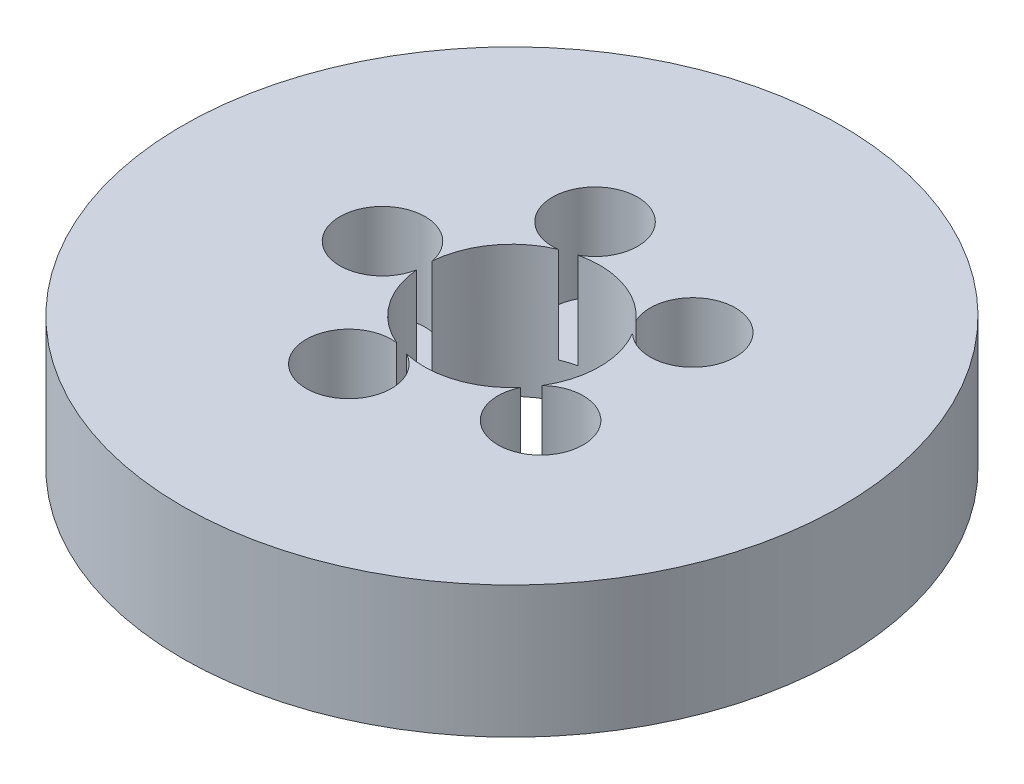
ISO-10303-21;
HEADER;
FILE_DESCRIPTION(('STEP AP214'),'2;1');
FILE_NAME('part.step','',(''),(''),'','','');
FILE_SCHEMA(('AUTOMOTIVE_DESIGN { 1 0 10303 214 1 1 1 1 }'));
ENDSEC;
DATA;
#1=APPLICATION_CONTEXT('core data for automotive mechanical design processes');
#2=APPLICATION_PROTOCOL_DEFINITION('international standard','automotive_design',2000,#1);
#3=PRODUCT_CONTEXT('',#1,'mechanical');
#4=PRODUCT('Part','Part','',(#3));
#5=PRODUCT_RELATED_PRODUCT_CATEGORY('part','',(#4));
#6=PRODUCT_DEFINITION_FORMATION('','',#4);
#7=PRODUCT_DEFINITION_CONTEXT('part definition',#1,'design');
#8=PRODUCT_DEFINITION('design','',#6,#7);
#9=PRODUCT_DEFINITION_SHAPE('','',#8);
#10=(LENGTH_UNIT() NAMED_UNIT(*) SI_UNIT(.MILLI.,.METRE.));
#11=(NAMED_UNIT(*) PLANE_ANGLE_UNIT() SI_UNIT($,.RADIAN.));
#12=(NAMED_UNIT(*) SI_UNIT($,.STERADIAN.) SOLID_ANGLE_UNIT());
#13=UNCERTAINTY_MEASURE_WITH_UNIT(LENGTH_MEASURE(1.E-05),#10,'distance_accuracy_value','');
#14=(GEOMETRIC_REPRESENTATION_CONTEXT(3) GLOBAL_UNCERTAINTY_ASSIGNED_CONTEXT((#13)) GLOBAL_UNIT_ASSIGNED_CONTEXT((#10,
#11,#12)) REPRESENTATION_CONTEXT('',''));
#15=CARTESIAN_POINT('',(0.,0.,0.));
#16=DIRECTION('',(0.,0.,1.));
#17=DIRECTION('',(1.,0.,0.));
#18=AXIS2_PLACEMENT_3D('',#15,#16,#17);
#19=CARTESIAN_POINT('',(0.,30.,0.));
#20=DIRECTION('',(0.,-1.,0.));
#21=DIRECTION('',(0.,0.,-1.));
#22=AXIS2_PLACEMENT_3D('',#19,#20,#21);
#23=CYLINDRICAL_SURFACE('',#22,75.);
#24=CARTESIAN_POINT('',(0.,30.,0.));
#25=DIRECTION('',(0.,1.,0.));
#26=DIRECTION('',(0.,0.,1.));
#27=AXIS2_PLACEMENT_3D('',#24,#25,#26);
#28=CIRCLE('',#27,75.);
#29=CARTESIAN_POINT('',(0.,30.,75.));
#30=VERTEX_POINT('',#29);
#31=EDGE_CURVE('E157',#30,#30,#28,.T.);
#32=ORIENTED_EDGE('',*,*,#31,.F.);
#33=EDGE_LOOP('',(#32));
#34=FACE_BOUND('',#33,.T.);
#35=CARTESIAN_POINT('',(0.,0.,0.));
#36=DIRECTION('',(0.,1.,0.));
#37=DIRECTION('',(0.,0.,1.));
#38=AXIS2_PLACEMENT_3D('',#35,#36,#37);
#39=CIRCLE('',#38,75.);
#40=CARTESIAN_POINT('',(0.,0.,75.));
#41=VERTEX_POINT('',#40);
#42=EDGE_CURVE('E150',#41,#41,#39,.T.);
#43=ORIENTED_EDGE('',*,*,#42,.T.);
#44=EDGE_LOOP('',(#43));
#45=FACE_BOUND('',#44,.T.);
#46=ADVANCED_FACE('F39',(#34,#45),#23,.T.);
#47=CARTESIAN_POINT('',(0.,30.,0.));
#48=DIRECTION('',(0.,1.,0.));
#49=DIRECTION('',(0.,0.,1.));
#50=AXIS2_PLACEMENT_3D('',#47,#48,#49);
#51=PLANE('',#50);
#52=CARTESIAN_POINT('',(-9.10388367389383,30.,-28.0188729075005));
#53=DIRECTION('',(0.,1.,0.));
#54=DIRECTION('',(-0.95105651629515,0.,0.309016994374958));
#55=AXIS2_PLACEMENT_3D('',#52,#53,#54);
#56=CIRCLE('',#55,9.70466536958862);
#57=CARTESIAN_POINT('',(-4.46338080502337,30.,-19.4955951894101));
#58=VERTEX_POINT('',#57);
#59=CARTESIAN_POINT('',(-7.84827241336889,30.,-18.3957772362451));
#60=VERTEX_POINT('',#59);
#61=EDGE_CURVE('E194',#58,#60,#56,.T.);
#62=ORIENTED_EDGE('',*,*,#61,.F.);
#63=CARTESIAN_POINT('',(0.,30.,0.));
#64=DIRECTION('',(0.,1.,0.));
#65=DIRECTION('',(0.,0.,1.));
#66=AXIS2_PLACEMENT_3D('',#63,#64,#65);
#67=CIRCLE('',#66,20.);
#68=CARTESIAN_POINT('',(15.0701742606299,30.,-13.1487584111295));
#69=VERTEX_POINT('',#68);
#70=EDGE_CURVE('E147',#69,#58,#67,.T.);
#71=ORIENTED_EDGE('',*,*,#70,.F.);
#72=CARTESIAN_POINT('',(23.8342768878783,30.,-17.3166157832992));
#73=DIRECTION('',(0.,1.,0.));
#74=DIRECTION('',(-0.58778525229248,0.,-0.809016994374942));
#75=AXIS2_PLACEMENT_3D('',#72,#73,#74);
#76=CIRCLE('',#75,9.70466536958862);
#77=CARTESIAN_POINT('',(17.1621523228218,30.,-10.2693976283063));
#78=VERTEX_POINT('',#77);
#79=EDGE_CURVE('E254',#78,#69,#76,.T.);
#80=ORIENTED_EDGE('',*,*,#79,.F.);
#81=CARTESIAN_POINT('',(17.1621523228219,30.,10.2693976283061));
#82=VERTEX_POINT('',#81);
#83=EDGE_CURVE('E144',#82,#78,#67,.T.);
#84=ORIENTED_EDGE('',*,*,#83,.F.);
#85=CARTESIAN_POINT('',(23.8342768878786,30.,17.3166157832989));
#86=DIRECTION('',(0.,1.,0.));
#87=DIRECTION('',(0.587785252292469,0.,-0.809016994374951));
#88=AXIS2_PLACEMENT_3D('',#85,#86,#87);
#89=CIRCLE('',#88,9.70466536958862);
#90=CARTESIAN_POINT('',(15.0701742606301,30.,13.1487584111293));
#91=VERTEX_POINT('',#90);
#92=EDGE_CURVE('E141',#91,#82,#89,.T.);
#93=ORIENTED_EDGE('',*,*,#92,.F.);
#94=CARTESIAN_POINT('',(-4.46338080502312,30.,19.4955951894101));
#95=VERTEX_POINT('',#94);
#96=EDGE_CURVE('E134',#95,#91,#67,.T.);
#97=ORIENTED_EDGE('',*,*,#96,.F.);
#98=CARTESIAN_POINT('',(-9.10388367389344,30.,28.0188729075007));
#99=DIRECTION('',(0.,1.,0.));
#100=DIRECTION('',(0.951056516295155,0.,0.309016994374945));
#101=AXIS2_PLACEMENT_3D('',#98,#99,#100);
#102=CIRCLE('',#101,9.70466536958862);
#103=CARTESIAN_POINT('',(-7.84827241336862,30.,18.3957772362452));
#104=VERTEX_POINT('',#103);
#105=EDGE_CURVE('E111',#104,#95,#102,.T.);
#106=ORIENTED_EDGE('',*,*,#105,.F.);
#107=CARTESIAN_POINT('',(-19.92067336506,30.,1.77954282965822));
#108=VERTEX_POINT('',#107);
#109=EDGE_CURVE('E145',#108,#104,#67,.T.);
#110=ORIENTED_EDGE('',*,*,#109,.F.);
#111=CARTESIAN_POINT('',(-29.4607864279699,30.,0.));
#112=DIRECTION('',(0.,1.,0.));
#113=DIRECTION('',(0.,0.,1.));
#114=AXIS2_PLACEMENT_3D('',#111,#112,#113);
#115=CIRCLE('',#114,9.70466536958862);
#116=CARTESIAN_POINT('',(-19.92067336506,30.,-1.77954282965822));
#117=VERTEX_POINT('',#116);
#118=EDGE_CURVE('E153',#117,#108,#115,.T.);
#119=ORIENTED_EDGE('',*,*,#118,.F.);
#120=EDGE_CURVE('E146',#60,#117,#67,.T.);
#121=ORIENTED_EDGE('',*,*,#120,.F.);
#122=EDGE_LOOP('',(#62,#71,#80,#84,#93,#97,#106,#110,#119,#121));
#123=FACE_BOUND('',#122,.T.);
#124=ORIENTED_EDGE('',*,*,#31,.T.);
#125=EDGE_LOOP('',(#124));
#126=FACE_BOUND('',#125,.T.);
#127=ADVANCED_FACE('F139',(#123,#126),#51,.T.);
#128=CARTESIAN_POINT('',(0.,0.,0.));
#129=DIRECTION('',(0.,1.,0.));
#130=DIRECTION('',(0.,0.,1.));
#131=AXIS2_PLACEMENT_3D('',#128,#129,#130);
#132=PLANE('',#131);
#133=CARTESIAN_POINT('',(0.,0.,0.));
#134=DIRECTION('',(0.,1.,0.));
#135=DIRECTION('',(0.,0.,1.));
#136=AXIS2_PLACEMENT_3D('',#133,#134,#135);
#137=CIRCLE('',#136,20.);
#138=CARTESIAN_POINT('',(0.,0.,20.));
#139=VERTEX_POINT('',#138);
#140=EDGE_CURVE('E154',#139,#139,#137,.T.);
#141=ORIENTED_EDGE('',*,*,#140,.T.);
#142=EDGE_LOOP('',(#141));
#143=FACE_BOUND('',#142,.T.);
#144=ORIENTED_EDGE('',*,*,#42,.F.);
#145=EDGE_LOOP('',(#144));
#146=FACE_BOUND('',#145,.T.);
#147=ADVANCED_FACE('F213',(#143,#146),#132,.F.);
#148=CARTESIAN_POINT('',(0.,30.,0.));
#149=DIRECTION('',(0.,-1.,0.));
#150=DIRECTION('',(0.,0.,-1.));
#151=AXIS2_PLACEMENT_3D('',#148,#149,#150);
#152=CYLINDRICAL_SURFACE('',#151,20.);
#153=DIRECTION('',(0.,1.,0.));
#154=VECTOR('',#153,1.);
#155=CARTESIAN_POINT('',(-4.46338080502336,19.104917149381,-19.4955951894101));
#156=LINE('',#155,#154);
#157=CARTESIAN_POINT('',(-4.46338080502337,8.209834298762,-19.4955951894101));
#158=VERTEX_POINT('',#157);
#159=EDGE_CURVE('E11',#158,#58,#156,.T.);
#160=ORIENTED_EDGE('',*,*,#159,.F.);
#161=CARTESIAN_POINT('',(0.,8.209834298762,0.));
#162=DIRECTION('',(0.,1.,0.));
#163=DIRECTION('',(0.,0.,1.));
#164=AXIS2_PLACEMENT_3D('',#161,#162,#163);
#165=CIRCLE('',#164,20.);
#166=CARTESIAN_POINT('',(-7.84827241336889,8.209834298762,-18.3957772362451));
#167=VERTEX_POINT('',#166);
#168=EDGE_CURVE('E189',#158,#167,#165,.T.);
#169=ORIENTED_EDGE('',*,*,#168,.T.);
#170=DIRECTION('',(0.,1.,0.));
#171=VECTOR('',#170,1.);
#172=CARTESIAN_POINT('',(-7.84827241336891,19.104917149381,-18.3957772362451));
#173=LINE('',#172,#171);
#174=EDGE_CURVE('E46',#60,#167,#173,.F.);
#175=ORIENTED_EDGE('',*,*,#174,.F.);
#176=ORIENTED_EDGE('',*,*,#120,.T.);
#177=DIRECTION('',(0.,1.,0.));
#178=VECTOR('',#177,1.);
#179=CARTESIAN_POINT('',(-19.92067336506,19.104917149381,-1.77954282965823));
#180=LINE('',#179,#178);
#181=CARTESIAN_POINT('',(-19.92067336506,8.209834298762,-1.77954282965822));
#182=VERTEX_POINT('',#181);
#183=EDGE_CURVE('E168',#182,#117,#180,.T.);
#184=ORIENTED_EDGE('',*,*,#183,.F.);
#185=CARTESIAN_POINT('',(0.,8.209834298762,0.));
#186=DIRECTION('',(0.,1.,0.));
#187=DIRECTION('',(0.,0.,1.));
#188=AXIS2_PLACEMENT_3D('',#185,#186,#187);
#189=CIRCLE('',#188,20.);
#190=CARTESIAN_POINT('',(-19.92067336506,8.209834298762,1.77954282965822));
#191=VERTEX_POINT('',#190);
#192=EDGE_CURVE('E165',#182,#191,#189,.T.);
#193=ORIENTED_EDGE('',*,*,#192,.T.);
#194=DIRECTION('',(0.,1.,0.));
#195=VECTOR('',#194,1.);
#196=CARTESIAN_POINT('',(-19.92067336506,19.104917149381,1.77954282965823));
#197=LINE('',#196,#195);
#198=EDGE_CURVE('E170',#108,#191,#197,.F.);
#199=ORIENTED_EDGE('',*,*,#198,.F.);
#200=ORIENTED_EDGE('',*,*,#109,.T.);
#201=DIRECTION('',(0.,1.,0.));
#202=VECTOR('',#201,1.);
#203=CARTESIAN_POINT('',(-7.84827241336862,19.104917149381,18.3957772362452));
#204=LINE('',#203,#202);
#205=CARTESIAN_POINT('',(-7.84827241336862,8.209834298762,18.3957772362452));
#206=VERTEX_POINT('',#205);
#207=EDGE_CURVE('E121',#206,#104,#204,.T.);
#208=ORIENTED_EDGE('',*,*,#207,.F.);
#209=CARTESIAN_POINT('',(0.,8.209834298762,0.));
#210=DIRECTION('',(0.,1.,0.));
#211=DIRECTION('',(0.,0.,1.));
#212=AXIS2_PLACEMENT_3D('',#209,#210,#211);
#213=CIRCLE('',#212,20.);
#214=CARTESIAN_POINT('',(-4.46338080502312,8.209834298762,19.4955951894101));
#215=VERTEX_POINT('',#214);
#216=EDGE_CURVE('E136',#206,#215,#213,.T.);
#217=ORIENTED_EDGE('',*,*,#216,.T.);
#218=DIRECTION('',(0.,1.,0.));
#219=VECTOR('',#218,1.);
#220=CARTESIAN_POINT('',(-4.46338080502311,19.104917149381,19.4955951894101));
#221=LINE('',#220,#219);
#222=EDGE_CURVE('E117',#95,#215,#221,.F.);
#223=ORIENTED_EDGE('',*,*,#222,.F.);
#224=ORIENTED_EDGE('',*,*,#96,.T.);
#225=DIRECTION('',(0.,1.,0.));
#226=VECTOR('',#225,1.);
#227=CARTESIAN_POINT('',(15.0701742606301,19.104917149381,13.1487584111293));
#228=LINE('',#227,#226);
#229=CARTESIAN_POINT('',(15.0701742606301,8.209834298762,13.1487584111293));
#230=VERTEX_POINT('',#229);
#231=EDGE_CURVE('E182',#230,#91,#228,.T.);
#232=ORIENTED_EDGE('',*,*,#231,.F.);
#233=CARTESIAN_POINT('',(0.,8.209834298762,0.));
#234=DIRECTION('',(0.,1.,0.));
#235=DIRECTION('',(0.,0.,1.));
#236=AXIS2_PLACEMENT_3D('',#233,#234,#235);
#237=CIRCLE('',#236,20.);
#238=CARTESIAN_POINT('',(17.1621523228219,8.209834298762,10.2693976283061));
#239=VERTEX_POINT('',#238);
#240=EDGE_CURVE('E174',#230,#239,#237,.T.);
#241=ORIENTED_EDGE('',*,*,#240,.T.);
#242=DIRECTION('',(0.,1.,0.));
#243=VECTOR('',#242,1.);
#244=CARTESIAN_POINT('',(17.1621523228219,19.104917149381,10.2693976283061));
#245=LINE('',#244,#243);
#246=EDGE_CURVE('E177',#82,#239,#245,.F.);
#247=ORIENTED_EDGE('',*,*,#246,.F.);
#248=ORIENTED_EDGE('',*,*,#83,.T.);
#249=DIRECTION('',(0.,1.,0.));
#250=VECTOR('',#249,1.);
#251=CARTESIAN_POINT('',(17.1621523228218,19.104917149381,-10.2693976283063));
#252=LINE('',#251,#250);
#253=CARTESIAN_POINT('',(17.1621523228218,8.209834298762,-10.2693976283063));
#254=VERTEX_POINT('',#253);
#255=EDGE_CURVE('E187',#254,#78,#252,.T.);
#256=ORIENTED_EDGE('',*,*,#255,.F.);
#257=CARTESIAN_POINT('',(0.,8.209834298762,0.));
#258=DIRECTION('',(0.,1.,0.));
#259=DIRECTION('',(0.,0.,1.));
#260=AXIS2_PLACEMENT_3D('',#257,#258,#259);
#261=CIRCLE('',#260,20.);
#262=CARTESIAN_POINT('',(15.0701742606299,8.209834298762,-13.1487584111295));
#263=VERTEX_POINT('',#262);
#264=EDGE_CURVE('E181',#254,#263,#261,.T.);
#265=ORIENTED_EDGE('',*,*,#264,.T.);
#266=DIRECTION('',(0.,1.,0.));
#267=VECTOR('',#266,1.);
#268=CARTESIAN_POINT('',(15.0701742606299,19.104917149381,-13.1487584111295));
#269=LINE('',#268,#267);
#270=EDGE_CURVE('E186',#69,#263,#269,.F.);
#271=ORIENTED_EDGE('',*,*,#270,.F.);
#272=ORIENTED_EDGE('',*,*,#70,.T.);
#273=EDGE_LOOP('',(#160,#169,#175,#176,#184,#193,#199,#200,#208,#217,#223,#224,#232,#241,#247,
#248,#256,#265,#271,#272));
#274=FACE_BOUND('',#273,.T.);
#275=ORIENTED_EDGE('',*,*,#140,.F.);
#276=EDGE_LOOP('',(#275));
#277=FACE_BOUND('',#276,.T.);
#278=ADVANCED_FACE('F135',(#274,#277),#152,.F.);
#279=CARTESIAN_POINT('',(-29.4607864279699,8.209834298762,0.));
#280=DIRECTION('',(0.,1.,0.));
#281=DIRECTION('',(0.,0.,1.));
#282=AXIS2_PLACEMENT_3D('',#279,#280,#281);
#283=CYLINDRICAL_SURFACE('',#282,9.70466536958862);
#284=ORIENTED_EDGE('',*,*,#183,.T.);
#285=ORIENTED_EDGE('',*,*,#118,.T.);
#286=ORIENTED_EDGE('',*,*,#198,.T.);
#287=CARTESIAN_POINT('',(-29.4607864279699,8.209834298762,0.));
#288=DIRECTION('',(0.,1.,0.));
#289=DIRECTION('',(0.,0.,1.));
#290=AXIS2_PLACEMENT_3D('',#287,#288,#289);
#291=CIRCLE('',#290,9.70466536958862);
#292=EDGE_CURVE('E158',#182,#191,#291,.T.);
#293=ORIENTED_EDGE('',*,*,#292,.F.);
#294=EDGE_LOOP('',(#284,#285,#286,#293));
#295=FACE_BOUND('',#294,.T.);
#296=ADVANCED_FACE('F221',(#295),#283,.F.);
#297=CARTESIAN_POINT('',(-29.4607864279699,8.209834298762,0.));
#298=DIRECTION('',(0.,1.,0.));
#299=DIRECTION('',(0.,0.,1.));
#300=AXIS2_PLACEMENT_3D('',#297,#298,#299);
#301=PLANE('',#300);
#302=ORIENTED_EDGE('',*,*,#292,.T.);
#303=ORIENTED_EDGE('',*,*,#192,.F.);
#304=EDGE_LOOP('',(#302,#303));
#305=FACE_BOUND('',#304,.T.);
#306=ADVANCED_FACE('F227',(#305),#301,.T.);
#307=CARTESIAN_POINT('',(-9.10388367389344,8.209834298762,28.0188729075007));
#308=DIRECTION('',(0.,1.,0.));
#309=DIRECTION('',(0.,0.,1.));
#310=AXIS2_PLACEMENT_3D('',#307,#308,#309);
#311=CYLINDRICAL_SURFACE('',#310,9.70466536958862);
#312=ORIENTED_EDGE('',*,*,#207,.T.);
#313=ORIENTED_EDGE('',*,*,#105,.T.);
#314=ORIENTED_EDGE('',*,*,#222,.T.);
#315=CARTESIAN_POINT('',(-9.10388367389344,8.209834298762,28.0188729075007));
#316=DIRECTION('',(0.,1.,0.));
#317=DIRECTION('',(0.951056516295155,0.,0.309016994374945));
#318=AXIS2_PLACEMENT_3D('',#315,#316,#317);
#319=CIRCLE('',#318,9.70466536958862);
#320=EDGE_CURVE('E127',#206,#215,#319,.T.);
#321=ORIENTED_EDGE('',*,*,#320,.F.);
#322=EDGE_LOOP('',(#312,#313,#314,#321));
#323=FACE_BOUND('',#322,.T.);
#324=ADVANCED_FACE('F116',(#323),#311,.F.);
#325=CARTESIAN_POINT('',(-9.10388367389344,8.209834298762,28.0188729075007));
#326=DIRECTION('',(0.,1.,0.));
#327=DIRECTION('',(0.951056516295155,0.,0.309016994374945));
#328=AXIS2_PLACEMENT_3D('',#325,#326,#327);
#329=PLANE('',#328);
#330=ORIENTED_EDGE('',*,*,#320,.T.);
#331=ORIENTED_EDGE('',*,*,#216,.F.);
#332=EDGE_LOOP('',(#330,#331));
#333=FACE_BOUND('',#332,.T.);
#334=ADVANCED_FACE('F234',(#333),#329,.T.);
#335=CARTESIAN_POINT('',(23.8342768878786,8.209834298762,17.3166157832989));
#336=DIRECTION('',(0.,1.,0.));
#337=DIRECTION('',(0.,0.,1.));
#338=AXIS2_PLACEMENT_3D('',#335,#336,#337);
#339=CYLINDRICAL_SURFACE('',#338,9.70466536958862);
#340=ORIENTED_EDGE('',*,*,#231,.T.);
#341=ORIENTED_EDGE('',*,*,#92,.T.);
#342=ORIENTED_EDGE('',*,*,#246,.T.);
#343=CARTESIAN_POINT('',(23.8342768878786,8.209834298762,17.3166157832989));
#344=DIRECTION('',(0.,1.,0.));
#345=DIRECTION('',(0.587785252292469,0.,-0.809016994374951));
#346=AXIS2_PLACEMENT_3D('',#343,#344,#345);
#347=CIRCLE('',#346,9.70466536958862);
#348=EDGE_CURVE('E130',#230,#239,#347,.T.);
#349=ORIENTED_EDGE('',*,*,#348,.F.);
#350=EDGE_LOOP('',(#340,#341,#342,#349));
#351=FACE_BOUND('',#350,.T.);
#352=ADVANCED_FACE('F240',(#351),#339,.F.);
#353=CARTESIAN_POINT('',(23.8342768878786,8.209834298762,17.3166157832989));
#354=DIRECTION('',(0.,1.,0.));
#355=DIRECTION('',(0.587785252292469,0.,-0.809016994374951));
#356=AXIS2_PLACEMENT_3D('',#353,#354,#355);
#357=PLANE('',#356);
#358=ORIENTED_EDGE('',*,*,#348,.T.);
#359=ORIENTED_EDGE('',*,*,#240,.F.);
#360=EDGE_LOOP('',(#358,#359));
#361=FACE_BOUND('',#360,.T.);
#362=ADVANCED_FACE('F245',(#361),#357,.T.);
#363=CARTESIAN_POINT('',(23.8342768878783,8.209834298762,-17.3166157832992));
#364=DIRECTION('',(0.,1.,0.));
#365=DIRECTION('',(0.,0.,1.));
#366=AXIS2_PLACEMENT_3D('',#363,#364,#365);
#367=CYLINDRICAL_SURFACE('',#366,9.70466536958862);
#368=ORIENTED_EDGE('',*,*,#255,.T.);
#369=ORIENTED_EDGE('',*,*,#79,.T.);
#370=ORIENTED_EDGE('',*,*,#270,.T.);
#371=CARTESIAN_POINT('',(23.8342768878783,8.209834298762,-17.3166157832992));
#372=DIRECTION('',(0.,1.,0.));
#373=DIRECTION('',(-0.58778525229248,0.,-0.809016994374942));
#374=AXIS2_PLACEMENT_3D('',#371,#372,#373);
#375=CIRCLE('',#374,9.70466536958862);
#376=EDGE_CURVE('E56',#254,#263,#375,.T.);
#377=ORIENTED_EDGE('',*,*,#376,.F.);
#378=EDGE_LOOP('',(#368,#369,#370,#377));
#379=FACE_BOUND('',#378,.T.);
#380=ADVANCED_FACE('F266',(#379),#367,.F.);
#381=CARTESIAN_POINT('',(23.8342768878783,8.209834298762,-17.3166157832992));
#382=DIRECTION('',(0.,1.,0.));
#383=DIRECTION('',(-0.58778525229248,0.,-0.809016994374942));
#384=AXIS2_PLACEMENT_3D('',#381,#382,#383);
#385=PLANE('',#384);
#386=ORIENTED_EDGE('',*,*,#376,.T.);
#387=ORIENTED_EDGE('',*,*,#264,.F.);
#388=EDGE_LOOP('',(#386,#387));
#389=FACE_BOUND('',#388,.T.);
#390=ADVANCED_FACE('F204',(#389),#385,.T.);
#391=CARTESIAN_POINT('',(-9.10388367389383,8.209834298762,-28.0188729075005));
#392=DIRECTION('',(0.,1.,0.));
#393=DIRECTION('',(0.,0.,1.));
#394=AXIS2_PLACEMENT_3D('',#391,#392,#393);
#395=CYLINDRICAL_SURFACE('',#394,9.70466536958862);
#396=ORIENTED_EDGE('',*,*,#159,.T.);
#397=ORIENTED_EDGE('',*,*,#61,.T.);
#398=ORIENTED_EDGE('',*,*,#174,.T.);
#399=CARTESIAN_POINT('',(-9.10388367389383,8.209834298762,-28.0188729075005));
#400=DIRECTION('',(0.,1.,0.));
#401=DIRECTION('',(-0.95105651629515,0.,0.309016994374958));
#402=AXIS2_PLACEMENT_3D('',#399,#400,#401);
#403=CIRCLE('',#402,9.70466536958862);
#404=EDGE_CURVE('E55',#158,#167,#403,.T.);
#405=ORIENTED_EDGE('',*,*,#404,.F.);
#406=EDGE_LOOP('',(#396,#397,#398,#405));
#407=FACE_BOUND('',#406,.T.);
#408=ADVANCED_FACE('F193',(#407),#395,.F.);
#409=CARTESIAN_POINT('',(-9.10388367389383,8.209834298762,-28.0188729075005));
#410=DIRECTION('',(0.,1.,0.));
#411=DIRECTION('',(-0.95105651629515,0.,0.309016994374958));
#412=AXIS2_PLACEMENT_3D('',#409,#410,#411);
#413=PLANE('',#412);
#414=ORIENTED_EDGE('',*,*,#404,.T.);
#415=ORIENTED_EDGE('',*,*,#168,.F.);
#416=EDGE_LOOP('',(#414,#415));
#417=FACE_BOUND('',#416,.T.);
#418=ADVANCED_FACE('F196',(#417),#413,.T.);
#419=CLOSED_SHELL('',(#46,#127,#147,#278,#296,#306,#324,#334,#352,#362,#380,#390,#408,#418));
#420=MANIFOLD_SOLID_BREP('B2',#419);
#421=ADVANCED_BREP_SHAPE_REPRESENTATION('',(#18,#420),#14);
#422=SHAPE_DEFINITION_REPRESENTATION(#9,#421);
ENDSEC;
END-ISO-10303-21;
